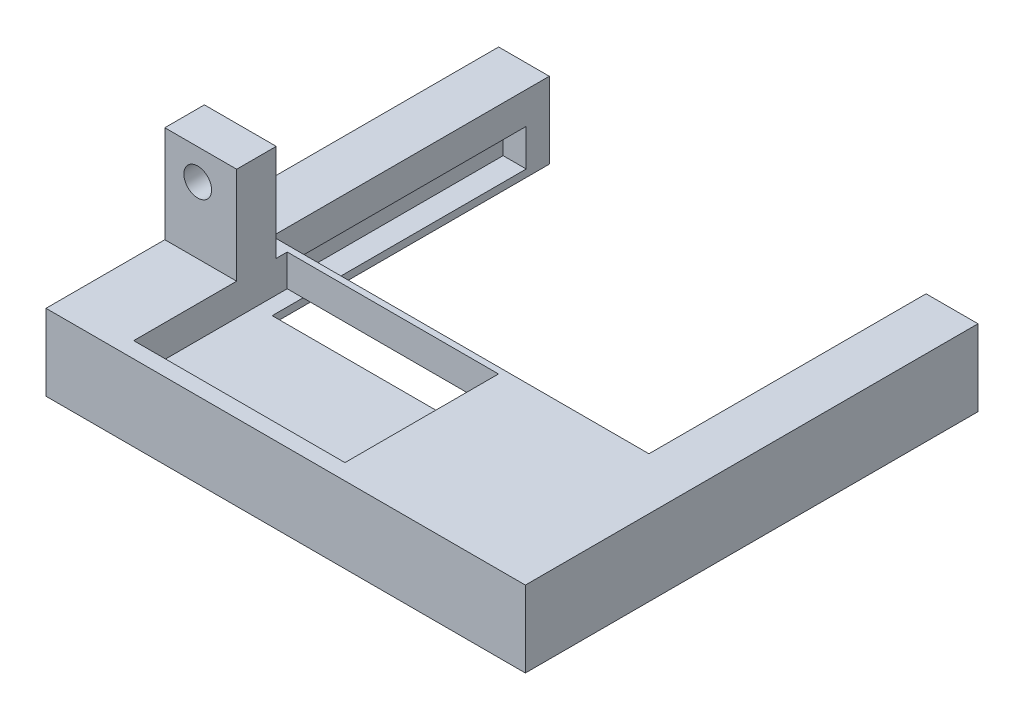
ISO-10303-21;
HEADER;
FILE_DESCRIPTION(('STEP AP214'),'2;1');
FILE_NAME('part.step','',(''),(''),'','','');
FILE_SCHEMA(('AUTOMOTIVE_DESIGN { 1 0 10303 214 1 1 1 1 }'));
ENDSEC;
DATA;
#1=APPLICATION_CONTEXT('core data for automotive mechanical design processes');
#2=APPLICATION_PROTOCOL_DEFINITION('international standard','automotive_design',2000,#1);
#3=PRODUCT_CONTEXT('',#1,'mechanical');
#4=PRODUCT('Part','Part','',(#3));
#5=PRODUCT_RELATED_PRODUCT_CATEGORY('part','',(#4));
#6=PRODUCT_DEFINITION_FORMATION('','',#4);
#7=PRODUCT_DEFINITION_CONTEXT('part definition',#1,'design');
#8=PRODUCT_DEFINITION('design','',#6,#7);
#9=PRODUCT_DEFINITION_SHAPE('','',#8);
#10=(LENGTH_UNIT() NAMED_UNIT(*) SI_UNIT(.MILLI.,.METRE.));
#11=(NAMED_UNIT(*) PLANE_ANGLE_UNIT() SI_UNIT($,.RADIAN.));
#12=(NAMED_UNIT(*) SI_UNIT($,.STERADIAN.) SOLID_ANGLE_UNIT());
#13=UNCERTAINTY_MEASURE_WITH_UNIT(LENGTH_MEASURE(1.E-05),#10,'distance_accuracy_value','');
#14=(GEOMETRIC_REPRESENTATION_CONTEXT(3) GLOBAL_UNCERTAINTY_ASSIGNED_CONTEXT((#13)) GLOBAL_UNIT_ASSIGNED_CONTEXT((#10,
#11,#12)) REPRESENTATION_CONTEXT('',''));
#15=CARTESIAN_POINT('',(0.,0.,0.));
#16=DIRECTION('',(0.,0.,1.));
#17=DIRECTION('',(1.,0.,0.));
#18=AXIS2_PLACEMENT_3D('',#15,#16,#17);
#19=CARTESIAN_POINT('',(-53.8026861703145,16.2377760510406,49.));
#20=DIRECTION('',(0.,-1.,0.));
#21=DIRECTION('',(0.,0.,-1.));
#22=AXIS2_PLACEMENT_3D('',#19,#20,#21);
#23=PLANE('',#22);
#24=DIRECTION('',(-1.,0.,0.));
#25=VECTOR('',#24,1.);
#26=CARTESIAN_POINT('',(-53.8026861703145,16.2377760510406,31.8534955891993));
#27=LINE('',#26,#25);
#28=CARTESIAN_POINT('',(-46.0237778029864,16.2377760510406,31.8534955891993));
#29=VERTEX_POINT('',#28);
#30=CARTESIAN_POINT('',(-53.8026861703145,16.2377760510406,31.8534955891993));
#31=VERTEX_POINT('',#30);
#32=EDGE_CURVE('E49',#29,#31,#27,.T.);
#33=ORIENTED_EDGE('',*,*,#32,.F.);
#34=DIRECTION('',(0.,0.,1.));
#35=VECTOR('',#34,1.);
#36=CARTESIAN_POINT('',(-46.0237778029864,16.2377760510406,30.6644437435466));
#37=LINE('',#36,#35);
#38=CARTESIAN_POINT('',(-46.0237778029864,16.2377760510406,30.6644437435466));
#39=VERTEX_POINT('',#38);
#40=EDGE_CURVE('E300',#39,#29,#37,.T.);
#41=ORIENTED_EDGE('',*,*,#40,.F.);
#42=DIRECTION('',(1.,0.,0.));
#43=VECTOR('',#42,1.);
#44=CARTESIAN_POINT('',(-46.0237778029864,16.2377760510406,30.6644437435466));
#45=LINE('',#44,#43);
#46=CARTESIAN_POINT('',(-23.1539622270134,16.2377760510406,30.6644437435466));
#47=VERTEX_POINT('',#46);
#48=EDGE_CURVE('E289',#39,#47,#45,.T.);
#49=ORIENTED_EDGE('',*,*,#48,.T.);
#50=DIRECTION('',(0.,0.,1.));
#51=VECTOR('',#50,1.);
#52=CARTESIAN_POINT('',(-23.1539622270134,16.2377760510406,30.6644437435466));
#53=LINE('',#52,#51);
#54=CARTESIAN_POINT('',(-23.1539622270134,16.2377760510406,47.2844241556345));
#55=VERTEX_POINT('',#54);
#56=EDGE_CURVE('E293',#47,#55,#53,.T.);
#57=ORIENTED_EDGE('',*,*,#56,.T.);
#58=DIRECTION('',(1.,0.,0.));
#59=VECTOR('',#58,1.);
#60=CARTESIAN_POINT('',(-46.0237778029864,16.2377760510406,47.2844241556345));
#61=LINE('',#60,#59);
#62=CARTESIAN_POINT('',(-46.0237778029864,16.2377760510406,47.2844241556345));
#63=VERTEX_POINT('',#62);
#64=EDGE_CURVE('E296',#63,#55,#61,.T.);
#65=ORIENTED_EDGE('',*,*,#64,.F.);
#66=CARTESIAN_POINT('',(-46.0237778029864,16.2377760510406,36.1384589133983));
#67=VERTEX_POINT('',#66);
#68=EDGE_CURVE('E299',#67,#63,#37,.T.);
#69=ORIENTED_EDGE('',*,*,#68,.F.);
#70=DIRECTION('',(1.,0.,0.));
#71=VECTOR('',#70,1.);
#72=CARTESIAN_POINT('',(-53.8026861703145,16.2377760510406,36.1384589133983));
#73=LINE('',#72,#71);
#74=CARTESIAN_POINT('',(-53.8026861703145,16.2377760510406,36.1384589133983));
#75=VERTEX_POINT('',#74);
#76=EDGE_CURVE('E419',#75,#67,#73,.T.);
#77=ORIENTED_EDGE('',*,*,#76,.F.);
#78=DIRECTION('',(0.,0.,-1.));
#79=VECTOR('',#78,1.);
#80=CARTESIAN_POINT('',(-53.8026861703145,16.2377760510406,49.));
#81=LINE('',#80,#79);
#82=CARTESIAN_POINT('',(-53.8026861703145,16.2377760510406,49.));
#83=VERTEX_POINT('',#82);
#84=EDGE_CURVE('E219',#83,#75,#81,.T.);
#85=ORIENTED_EDGE('',*,*,#84,.F.);
#86=DIRECTION('',(-1.,0.,0.));
#87=VECTOR('',#86,1.);
#88=CARTESIAN_POINT('',(-53.8026861703145,16.2377760510406,49.));
#89=LINE('',#88,#87);
#90=CARTESIAN_POINT('',(-1.90676536553269,16.2377760510406,49.));
#91=VERTEX_POINT('',#90);
#92=EDGE_CURVE('E344',#91,#83,#89,.T.);
#93=ORIENTED_EDGE('',*,*,#92,.F.);
#94=DIRECTION('',(0.,0.,-1.));
#95=VECTOR('',#94,1.);
#96=CARTESIAN_POINT('',(-1.90676536553269,16.2377760510406,49.));
#97=LINE('',#96,#95);
#98=CARTESIAN_POINT('',(-1.90676536553269,16.2377760510406,0.));
#99=VERTEX_POINT('',#98);
#100=EDGE_CURVE('E42',#91,#99,#97,.T.);
#101=ORIENTED_EDGE('',*,*,#100,.T.);
#102=DIRECTION('',(-1.,0.,0.));
#103=VECTOR('',#102,1.);
#104=CARTESIAN_POINT('',(-53.8026861703145,16.2377760510406,0.));
#105=LINE('',#104,#103);
#106=CARTESIAN_POINT('',(-7.526984080159,16.2377760510406,0.));
#107=VERTEX_POINT('',#106);
#108=EDGE_CURVE('E355',#99,#107,#105,.T.);
#109=ORIENTED_EDGE('',*,*,#108,.T.);
#110=DIRECTION('',(0.,0.,-1.));
#111=VECTOR('',#110,1.);
#112=CARTESIAN_POINT('',(-7.526984080159,16.2377760510406,30.));
#113=LINE('',#112,#111);
#114=CARTESIAN_POINT('',(-7.526984080159,16.2377760510406,30.));
#115=VERTEX_POINT('',#114);
#116=EDGE_CURVE('E327',#115,#107,#113,.T.);
#117=ORIENTED_EDGE('',*,*,#116,.F.);
#118=DIRECTION('',(-1.,0.,0.));
#119=VECTOR('',#118,1.);
#120=CARTESIAN_POINT('',(-7.526984080159,16.2377760510406,30.));
#121=LINE('',#120,#119);
#122=CARTESIAN_POINT('',(-48.3159584688224,16.2377760510406,30.));
#123=VERTEX_POINT('',#122);
#124=EDGE_CURVE('E312',#115,#123,#121,.T.);
#125=ORIENTED_EDGE('',*,*,#124,.T.);
#126=DIRECTION('',(0.,0.,-1.));
#127=VECTOR('',#126,1.);
#128=CARTESIAN_POINT('',(-48.3159584688224,16.2377760510406,30.));
#129=LINE('',#128,#127);
#130=CARTESIAN_POINT('',(-48.3159584688224,16.2377760510406,0.));
#131=VERTEX_POINT('',#130);
#132=EDGE_CURVE('E337',#123,#131,#129,.T.);
#133=ORIENTED_EDGE('',*,*,#132,.T.);
#134=CARTESIAN_POINT('',(-53.8026861703145,16.2377760510406,0.));
#135=VERTEX_POINT('',#134);
#136=EDGE_CURVE('E354',#131,#135,#105,.T.);
#137=ORIENTED_EDGE('',*,*,#136,.T.);
#138=EDGE_CURVE('E54',#31,#135,#81,.T.);
#139=ORIENTED_EDGE('',*,*,#138,.F.);
#140=EDGE_LOOP('',(#33,#41,#49,#57,#65,#69,#77,#85,#93,#101,#109,#117,#125,#133,#137,#139));
#141=FACE_BOUND('',#140,.T.);
#142=ADVANCED_FACE('F33',(#141),#23,.F.);
#143=CARTESIAN_POINT('',(0.,0.,30.));
#144=DIRECTION('',(0.,0.,1.));
#145=DIRECTION('',(1.,0.,0.));
#146=AXIS2_PLACEMENT_3D('',#143,#144,#145);
#147=PLANE('',#146);
#148=DIRECTION('',(0.,-1.,0.));
#149=VECTOR('',#148,1.);
#150=CARTESIAN_POINT('',(-7.526984080159,16.2377760510406,30.));
#151=LINE('',#150,#149);
#152=CARTESIAN_POINT('',(-7.526984080159,12.7911909617181,30.));
#153=VERTEX_POINT('',#152);
#154=EDGE_CURVE('E324',#115,#153,#151,.T.);
#155=ORIENTED_EDGE('',*,*,#154,.T.);
#156=DIRECTION('',(1.,0.,0.));
#157=VECTOR('',#156,1.);
#158=CARTESIAN_POINT('',(-5.026984080159,12.7911909617181,30.));
#159=LINE('',#158,#157);
#160=CARTESIAN_POINT('',(-48.3159584688224,12.7911909617181,30.));
#161=VERTEX_POINT('',#160);
#162=EDGE_CURVE('E222',#161,#153,#159,.T.);
#163=ORIENTED_EDGE('',*,*,#162,.F.);
#164=DIRECTION('',(0.,-1.,0.));
#165=VECTOR('',#164,1.);
#166=CARTESIAN_POINT('',(-48.3159584688224,16.2377760510406,30.));
#167=LINE('',#166,#165);
#168=EDGE_CURVE('E317',#123,#161,#167,.T.);
#169=ORIENTED_EDGE('',*,*,#168,.F.);
#170=ORIENTED_EDGE('',*,*,#124,.F.);
#171=EDGE_LOOP('',(#155,#163,#169,#170));
#172=FACE_BOUND('',#171,.T.);
#173=ADVANCED_FACE('F407',(#172),#147,.F.);
#174=CARTESIAN_POINT('',(-53.8026861703145,7.99119096171808,49.));
#175=DIRECTION('',(0.,1.,0.));
#176=DIRECTION('',(0.,0.,1.));
#177=AXIS2_PLACEMENT_3D('',#174,#175,#176);
#178=PLANE('',#177);
#179=DIRECTION('',(0.,0.,-1.));
#180=VECTOR('',#179,1.);
#181=CARTESIAN_POINT('',(-48.3159584688224,7.99119096171808,30.));
#182=LINE('',#181,#180);
#183=CARTESIAN_POINT('',(-48.3159584688224,7.99119096171808,30.));
#184=VERTEX_POINT('',#183);
#185=CARTESIAN_POINT('',(-48.3159584688224,7.99119096171808,0.));
#186=VERTEX_POINT('',#185);
#187=EDGE_CURVE('E335',#184,#186,#182,.T.);
#188=ORIENTED_EDGE('',*,*,#187,.F.);
#189=DIRECTION('',(-1.,0.,0.));
#190=VECTOR('',#189,1.);
#191=CARTESIAN_POINT('',(-7.526984080159,7.99119096171808,30.));
#192=LINE('',#191,#190);
#193=CARTESIAN_POINT('',(-7.526984080159,7.99119096171808,30.));
#194=VERTEX_POINT('',#193);
#195=EDGE_CURVE('E320',#194,#184,#192,.T.);
#196=ORIENTED_EDGE('',*,*,#195,.F.);
#197=DIRECTION('',(0.,0.,-1.));
#198=VECTOR('',#197,1.);
#199=CARTESIAN_POINT('',(-7.526984080159,7.99119096171808,30.));
#200=LINE('',#199,#198);
#201=CARTESIAN_POINT('',(-7.526984080159,7.99119096171808,0.));
#202=VERTEX_POINT('',#201);
#203=EDGE_CURVE('E332',#194,#202,#200,.T.);
#204=ORIENTED_EDGE('',*,*,#203,.T.);
#205=DIRECTION('',(1.,0.,0.));
#206=VECTOR('',#205,1.);
#207=CARTESIAN_POINT('',(-53.8026861703145,7.99119096171808,0.));
#208=LINE('',#207,#206);
#209=CARTESIAN_POINT('',(-1.90676536553269,7.99119096171808,0.));
#210=VERTEX_POINT('',#209);
#211=EDGE_CURVE('E360',#202,#210,#208,.T.);
#212=ORIENTED_EDGE('',*,*,#211,.T.);
#213=DIRECTION('',(0.,0.,-1.));
#214=VECTOR('',#213,1.);
#215=CARTESIAN_POINT('',(-1.90676536553269,7.99119096171808,49.));
#216=LINE('',#215,#214);
#217=CARTESIAN_POINT('',(-1.90676536553269,7.99119096171808,49.));
#218=VERTEX_POINT('',#217);
#219=EDGE_CURVE('E351',#218,#210,#216,.T.);
#220=ORIENTED_EDGE('',*,*,#219,.F.);
#221=DIRECTION('',(1.,0.,0.));
#222=VECTOR('',#221,1.);
#223=CARTESIAN_POINT('',(-53.8026861703145,7.99119096171808,49.));
#224=LINE('',#223,#222);
#225=CARTESIAN_POINT('',(-53.8026861703145,7.99119096171808,49.));
#226=VERTEX_POINT('',#225);
#227=EDGE_CURVE('E349',#226,#218,#224,.T.);
#228=ORIENTED_EDGE('',*,*,#227,.F.);
#229=DIRECTION('',(0.,0.,-1.));
#230=VECTOR('',#229,1.);
#231=CARTESIAN_POINT('',(-53.8026861703145,7.99119096171808,49.));
#232=LINE('',#231,#230);
#233=CARTESIAN_POINT('',(-53.8026861703145,7.99119096171808,0.));
#234=VERTEX_POINT('',#233);
#235=EDGE_CURVE('E365',#226,#234,#232,.T.);
#236=ORIENTED_EDGE('',*,*,#235,.T.);
#237=EDGE_CURVE('E345',#234,#186,#208,.T.);
#238=ORIENTED_EDGE('',*,*,#237,.T.);
#239=EDGE_LOOP('',(#188,#196,#204,#212,#220,#228,#236,#238));
#240=FACE_BOUND('',#239,.T.);
#241=ADVANCED_FACE('F389',(#240),#178,.F.);
#242=CARTESIAN_POINT('',(0.,0.,0.));
#243=DIRECTION('',(0.,0.,1.));
#244=DIRECTION('',(1.,0.,0.));
#245=AXIS2_PLACEMENT_3D('',#242,#243,#244);
#246=PLANE('',#245);
#247=DIRECTION('',(0.,-1.,0.));
#248=VECTOR('',#247,1.);
#249=CARTESIAN_POINT('',(-48.3159584688224,16.2377760510406,0.));
#250=LINE('',#249,#248);
#251=EDGE_CURVE('E311',#131,#186,#250,.T.);
#252=ORIENTED_EDGE('',*,*,#251,.T.);
#253=ORIENTED_EDGE('',*,*,#237,.F.);
#254=DIRECTION('',(0.,-1.,0.));
#255=VECTOR('',#254,1.);
#256=CARTESIAN_POINT('',(-53.8026861703145,16.2377760510406,0.));
#257=LINE('',#256,#255);
#258=EDGE_CURVE('E358',#135,#234,#257,.T.);
#259=ORIENTED_EDGE('',*,*,#258,.F.);
#260=ORIENTED_EDGE('',*,*,#136,.F.);
#261=EDGE_LOOP('',(#252,#253,#259,#260));
#262=FACE_BOUND('',#261,.T.);
#263=ADVANCED_FACE('F413',(#262),#246,.F.);
#264=CARTESIAN_POINT('',(-1.90676536553269,16.2377760510406,49.));
#265=DIRECTION('',(-1.,0.,0.));
#266=DIRECTION('',(0.,0.,1.));
#267=AXIS2_PLACEMENT_3D('',#264,#265,#266);
#268=PLANE('',#267);
#269=DIRECTION('',(0.,1.,0.));
#270=VECTOR('',#269,1.);
#271=CARTESIAN_POINT('',(-1.90676536553269,16.2377760510406,0.));
#272=LINE('',#271,#270);
#273=EDGE_CURVE('E340',#210,#99,#272,.T.);
#274=ORIENTED_EDGE('',*,*,#273,.T.);
#275=ORIENTED_EDGE('',*,*,#100,.F.);
#276=DIRECTION('',(0.,1.,0.));
#277=VECTOR('',#276,1.);
#278=CARTESIAN_POINT('',(-1.90676536553269,16.2377760510406,49.));
#279=LINE('',#278,#277);
#280=EDGE_CURVE('E341',#218,#91,#279,.T.);
#281=ORIENTED_EDGE('',*,*,#280,.F.);
#282=ORIENTED_EDGE('',*,*,#219,.T.);
#283=EDGE_LOOP('',(#274,#275,#281,#282));
#284=FACE_BOUND('',#283,.T.);
#285=ADVANCED_FACE('F35',(#284),#268,.F.);
#286=CARTESIAN_POINT('',(-53.8026861703145,16.2377760510406,49.));
#287=DIRECTION('',(1.,0.,0.));
#288=DIRECTION('',(0.,0.,-1.));
#289=AXIS2_PLACEMENT_3D('',#286,#287,#288);
#290=PLANE('',#289);
#291=ORIENTED_EDGE('',*,*,#258,.T.);
#292=ORIENTED_EDGE('',*,*,#235,.F.);
#293=DIRECTION('',(0.,-1.,0.));
#294=VECTOR('',#293,1.);
#295=CARTESIAN_POINT('',(-53.8026861703145,16.2377760510406,49.));
#296=LINE('',#295,#294);
#297=EDGE_CURVE('E347',#83,#226,#296,.T.);
#298=ORIENTED_EDGE('',*,*,#297,.F.);
#299=ORIENTED_EDGE('',*,*,#84,.T.);
#300=DIRECTION('',(0.,-1.,0.));
#301=VECTOR('',#300,1.);
#302=CARTESIAN_POINT('',(-53.8026861703145,26.7377760510406,36.1384589133983));
#303=LINE('',#302,#301);
#304=CARTESIAN_POINT('',(-53.8026861703145,26.7377760510406,36.1384589133983));
#305=VERTEX_POINT('',#304);
#306=EDGE_CURVE('E199',#305,#75,#303,.T.);
#307=ORIENTED_EDGE('',*,*,#306,.F.);
#308=DIRECTION('',(0.,0.,1.));
#309=VECTOR('',#308,1.);
#310=CARTESIAN_POINT('',(-53.8026861703145,26.7377760510406,31.8534955891993));
#311=LINE('',#310,#309);
#312=CARTESIAN_POINT('',(-53.8026861703145,26.7377760510406,31.8534955891993));
#313=VERTEX_POINT('',#312);
#314=EDGE_CURVE('E205',#313,#305,#311,.T.);
#315=ORIENTED_EDGE('',*,*,#314,.F.);
#316=DIRECTION('',(0.,-1.,0.));
#317=VECTOR('',#316,1.);
#318=CARTESIAN_POINT('',(-53.8026861703145,26.7377760510406,31.8534955891993));
#319=LINE('',#318,#317);
#320=EDGE_CURVE('E428',#313,#31,#319,.T.);
#321=ORIENTED_EDGE('',*,*,#320,.T.);
#322=ORIENTED_EDGE('',*,*,#138,.T.);
#323=EDGE_LOOP('',(#291,#292,#298,#299,#307,#315,#321,#322));
#324=FACE_BOUND('',#323,.T.);
#325=ADVANCED_FACE('F216',(#324),#290,.F.);
#326=CARTESIAN_POINT('',(0.,0.,49.));
#327=DIRECTION('',(0.,0.,1.));
#328=DIRECTION('',(1.,0.,0.));
#329=AXIS2_PLACEMENT_3D('',#326,#327,#328);
#330=PLANE('',#329);
#331=ORIENTED_EDGE('',*,*,#280,.T.);
#332=ORIENTED_EDGE('',*,*,#92,.T.);
#333=ORIENTED_EDGE('',*,*,#297,.T.);
#334=ORIENTED_EDGE('',*,*,#227,.T.);
#335=EDGE_LOOP('',(#331,#332,#333,#334));
#336=FACE_BOUND('',#335,.T.);
#337=ADVANCED_FACE('F418',(#336),#330,.T.);
#338=ORIENTED_EDGE('',*,*,#211,.F.);
#339=DIRECTION('',(0.,-1.,0.));
#340=VECTOR('',#339,1.);
#341=CARTESIAN_POINT('',(-7.526984080159,16.2377760510406,0.));
#342=LINE('',#341,#340);
#343=EDGE_CURVE('E316',#107,#202,#342,.T.);
#344=ORIENTED_EDGE('',*,*,#343,.F.);
#345=ORIENTED_EDGE('',*,*,#108,.F.);
#346=ORIENTED_EDGE('',*,*,#273,.F.);
#347=EDGE_LOOP('',(#338,#344,#345,#346));
#348=FACE_BOUND('',#347,.T.);
#349=ADVANCED_FACE('F378',(#348),#246,.F.);
#350=CARTESIAN_POINT('',(-48.3159584688224,16.2377760510406,30.));
#351=DIRECTION('',(1.,0.,0.));
#352=DIRECTION('',(0.,0.,-1.));
#353=AXIS2_PLACEMENT_3D('',#350,#351,#352);
#354=PLANE('',#353);
#355=DIRECTION('',(0.,0.,-1.));
#356=VECTOR('',#355,1.);
#357=CARTESIAN_POINT('',(-48.3159584688224,8.79119096171808,2.5));
#358=LINE('',#357,#356);
#359=CARTESIAN_POINT('',(-48.3159584688224,8.79119096171807,30.));
#360=VERTEX_POINT('',#359);
#361=CARTESIAN_POINT('',(-48.3159584688224,8.79119096171808,2.5));
#362=VERTEX_POINT('',#361);
#363=EDGE_CURVE('E253',#360,#362,#358,.T.);
#364=ORIENTED_EDGE('',*,*,#363,.F.);
#365=EDGE_CURVE('E315',#360,#184,#167,.T.);
#366=ORIENTED_EDGE('',*,*,#365,.T.);
#367=ORIENTED_EDGE('',*,*,#187,.T.);
#368=ORIENTED_EDGE('',*,*,#251,.F.);
#369=ORIENTED_EDGE('',*,*,#132,.F.);
#370=ORIENTED_EDGE('',*,*,#168,.T.);
#371=DIRECTION('',(0.,0.,1.));
#372=VECTOR('',#371,1.);
#373=CARTESIAN_POINT('',(-48.3159584688224,12.7911909617181,2.5));
#374=LINE('',#373,#372);
#375=CARTESIAN_POINT('',(-48.3159584688224,12.7911909617181,2.5));
#376=VERTEX_POINT('',#375);
#377=EDGE_CURVE('E261',#376,#161,#374,.T.);
#378=ORIENTED_EDGE('',*,*,#377,.F.);
#379=DIRECTION('',(0.,1.,0.));
#380=VECTOR('',#379,1.);
#381=CARTESIAN_POINT('',(-48.3159584688224,12.7911909617181,2.5));
#382=LINE('',#381,#380);
#383=EDGE_CURVE('E248',#362,#376,#382,.T.);
#384=ORIENTED_EDGE('',*,*,#383,.F.);
#385=EDGE_LOOP('',(#364,#366,#367,#368,#369,#370,#378,#384));
#386=FACE_BOUND('',#385,.T.);
#387=ADVANCED_FACE('F471',(#386),#354,.T.);
#388=CARTESIAN_POINT('',(-7.526984080159,16.2377760510406,30.));
#389=DIRECTION('',(1.,0.,0.));
#390=DIRECTION('',(0.,1.,0.));
#391=AXIS2_PLACEMENT_3D('',#388,#389,#390);
#392=PLANE('',#391);
#393=DIRECTION('',(0.,-1.,0.));
#394=VECTOR('',#393,1.);
#395=CARTESIAN_POINT('',(-7.526984080159,12.7911909617181,2.5));
#396=LINE('',#395,#394);
#397=CARTESIAN_POINT('',(-7.526984080159,12.7911909617181,2.5));
#398=VERTEX_POINT('',#397);
#399=CARTESIAN_POINT('',(-7.526984080159,8.79119096171808,2.5));
#400=VERTEX_POINT('',#399);
#401=EDGE_CURVE('E268',#398,#400,#396,.T.);
#402=ORIENTED_EDGE('',*,*,#401,.F.);
#403=DIRECTION('',(0.,0.,-1.));
#404=VECTOR('',#403,1.);
#405=CARTESIAN_POINT('',(-7.526984080159,12.7911909617181,2.5));
#406=LINE('',#405,#404);
#407=EDGE_CURVE('E274',#153,#398,#406,.T.);
#408=ORIENTED_EDGE('',*,*,#407,.F.);
#409=ORIENTED_EDGE('',*,*,#154,.F.);
#410=ORIENTED_EDGE('',*,*,#116,.T.);
#411=ORIENTED_EDGE('',*,*,#343,.T.);
#412=ORIENTED_EDGE('',*,*,#203,.F.);
#413=CARTESIAN_POINT('',(-7.526984080159,8.79119096171807,30.));
#414=VERTEX_POINT('',#413);
#415=EDGE_CURVE('E323',#414,#194,#151,.T.);
#416=ORIENTED_EDGE('',*,*,#415,.F.);
#417=DIRECTION('',(0.,0.,1.));
#418=VECTOR('',#417,1.);
#419=CARTESIAN_POINT('',(-7.526984080159,8.79119096171808,2.5));
#420=LINE('',#419,#418);
#421=EDGE_CURVE('E282',#400,#414,#420,.T.);
#422=ORIENTED_EDGE('',*,*,#421,.F.);
#423=EDGE_LOOP('',(#402,#408,#409,#410,#411,#412,#416,#422));
#424=FACE_BOUND('',#423,.T.);
#425=ADVANCED_FACE('F383',(#424),#392,.F.);
#426=ORIENTED_EDGE('',*,*,#365,.F.);
#427=DIRECTION('',(-1.,0.,0.));
#428=VECTOR('',#427,1.);
#429=CARTESIAN_POINT('',(-5.026984080159,8.79119096171807,30.));
#430=LINE('',#429,#428);
#431=EDGE_CURVE('E220',#414,#360,#430,.T.);
#432=ORIENTED_EDGE('',*,*,#431,.F.);
#433=ORIENTED_EDGE('',*,*,#415,.T.);
#434=ORIENTED_EDGE('',*,*,#195,.T.);
#435=EDGE_LOOP('',(#426,#432,#433,#434));
#436=FACE_BOUND('',#435,.T.);
#437=ADVANCED_FACE('F392',(#436),#147,.F.);
#438=CARTESIAN_POINT('',(-46.0237778029864,10.2377760510406,30.6644437435466));
#439=DIRECTION('',(0.,0.,1.));
#440=DIRECTION('',(1.,0.,0.));
#441=AXIS2_PLACEMENT_3D('',#438,#439,#440);
#442=PLANE('',#441);
#443=DIRECTION('',(-1.,0.,0.));
#444=VECTOR('',#443,1.);
#445=CARTESIAN_POINT('',(-46.0237778029864,12.7911909617181,30.6644437435466));
#446=LINE('',#445,#444);
#447=CARTESIAN_POINT('',(-23.1539622270134,12.7911909617181,30.6644437435466));
#448=VERTEX_POINT('',#447);
#449=CARTESIAN_POINT('',(-46.0237778029864,12.7911909617181,30.6644437435466));
#450=VERTEX_POINT('',#449);
#451=EDGE_CURVE('E246',#448,#450,#446,.T.);
#452=ORIENTED_EDGE('',*,*,#451,.F.);
#453=DIRECTION('',(0.,1.,0.));
#454=VECTOR('',#453,1.);
#455=CARTESIAN_POINT('',(-23.1539622270134,10.2377760510406,30.6644437435466));
#456=LINE('',#455,#454);
#457=EDGE_CURVE('E309',#448,#47,#456,.T.);
#458=ORIENTED_EDGE('',*,*,#457,.T.);
#459=ORIENTED_EDGE('',*,*,#48,.F.);
#460=DIRECTION('',(0.,1.,0.));
#461=VECTOR('',#460,1.);
#462=CARTESIAN_POINT('',(-46.0237778029864,10.2377760510406,30.6644437435466));
#463=LINE('',#462,#461);
#464=EDGE_CURVE('E302',#450,#39,#463,.T.);
#465=ORIENTED_EDGE('',*,*,#464,.F.);
#466=EDGE_LOOP('',(#452,#458,#459,#465));
#467=FACE_BOUND('',#466,.T.);
#468=ADVANCED_FACE('F441',(#467),#442,.T.);
#469=CARTESIAN_POINT('',(-23.1539622270134,10.2377760510406,30.6644437435466));
#470=DIRECTION('',(-1.,0.,0.));
#471=DIRECTION('',(0.,0.,1.));
#472=AXIS2_PLACEMENT_3D('',#469,#470,#471);
#473=PLANE('',#472);
#474=DIRECTION('',(0.,0.,-1.));
#475=VECTOR('',#474,1.);
#476=CARTESIAN_POINT('',(-23.1539622270134,12.7911909617181,30.6644437435466));
#477=LINE('',#476,#475);
#478=CARTESIAN_POINT('',(-23.1539622270134,12.7911909617181,47.2844241556345));
#479=VERTEX_POINT('',#478);
#480=EDGE_CURVE('E244',#479,#448,#477,.T.);
#481=ORIENTED_EDGE('',*,*,#480,.F.);
#482=DIRECTION('',(0.,1.,0.));
#483=VECTOR('',#482,1.);
#484=CARTESIAN_POINT('',(-23.1539622270134,10.2377760510406,47.2844241556345));
#485=LINE('',#484,#483);
#486=EDGE_CURVE('E307',#479,#55,#485,.T.);
#487=ORIENTED_EDGE('',*,*,#486,.T.);
#488=ORIENTED_EDGE('',*,*,#56,.F.);
#489=ORIENTED_EDGE('',*,*,#457,.F.);
#490=EDGE_LOOP('',(#481,#487,#488,#489));
#491=FACE_BOUND('',#490,.T.);
#492=ADVANCED_FACE('F445',(#491),#473,.T.);
#493=CARTESIAN_POINT('',(-46.0237778029864,10.2377760510406,47.2844241556345));
#494=DIRECTION('',(0.,0.,1.));
#495=DIRECTION('',(1.,0.,0.));
#496=AXIS2_PLACEMENT_3D('',#493,#494,#495);
#497=PLANE('',#496);
#498=ORIENTED_EDGE('',*,*,#486,.F.);
#499=DIRECTION('',(-1.,0.,0.));
#500=VECTOR('',#499,1.);
#501=CARTESIAN_POINT('',(-46.0237778029864,12.7911909617181,47.2844241556345));
#502=LINE('',#501,#500);
#503=CARTESIAN_POINT('',(-46.0237778029864,12.7911909617181,47.2844241556345));
#504=VERTEX_POINT('',#503);
#505=EDGE_CURVE('E239',#479,#504,#502,.T.);
#506=ORIENTED_EDGE('',*,*,#505,.T.);
#507=DIRECTION('',(0.,1.,0.));
#508=VECTOR('',#507,1.);
#509=CARTESIAN_POINT('',(-46.0237778029864,10.2377760510406,47.2844241556345));
#510=LINE('',#509,#508);
#511=EDGE_CURVE('E304',#504,#63,#510,.T.);
#512=ORIENTED_EDGE('',*,*,#511,.T.);
#513=ORIENTED_EDGE('',*,*,#64,.T.);
#514=EDGE_LOOP('',(#498,#506,#512,#513));
#515=FACE_BOUND('',#514,.T.);
#516=ADVANCED_FACE('F448',(#515),#497,.F.);
#517=CARTESIAN_POINT('',(-46.0237778029864,10.2377760510406,30.6644437435466));
#518=DIRECTION('',(-1.,0.,0.));
#519=DIRECTION('',(0.,0.,1.));
#520=AXIS2_PLACEMENT_3D('',#517,#518,#519);
#521=PLANE('',#520);
#522=ORIENTED_EDGE('',*,*,#511,.F.);
#523=DIRECTION('',(0.,0.,-1.));
#524=VECTOR('',#523,1.);
#525=CARTESIAN_POINT('',(-46.0237778029864,12.7911909617181,30.6644437435466));
#526=LINE('',#525,#524);
#527=EDGE_CURVE('E11',#504,#450,#526,.T.);
#528=ORIENTED_EDGE('',*,*,#527,.T.);
#529=ORIENTED_EDGE('',*,*,#464,.T.);
#530=ORIENTED_EDGE('',*,*,#40,.T.);
#531=DIRECTION('',(0.,-1.,0.));
#532=VECTOR('',#531,1.);
#533=CARTESIAN_POINT('',(-46.0237778029864,26.7377760510406,31.8534955891993));
#534=LINE('',#533,#532);
#535=CARTESIAN_POINT('',(-46.0237778029864,26.7377760510406,31.8534955891993));
#536=VERTEX_POINT('',#535);
#537=EDGE_CURVE('E224',#536,#29,#534,.T.);
#538=ORIENTED_EDGE('',*,*,#537,.F.);
#539=DIRECTION('',(0.,0.,-1.));
#540=VECTOR('',#539,1.);
#541=CARTESIAN_POINT('',(-46.0237778029864,26.7377760510406,31.8534955891993));
#542=LINE('',#541,#540);
#543=CARTESIAN_POINT('',(-46.0237778029864,26.7377760510406,36.1384589133983));
#544=VERTEX_POINT('',#543);
#545=EDGE_CURVE('E204',#544,#536,#542,.T.);
#546=ORIENTED_EDGE('',*,*,#545,.F.);
#547=DIRECTION('',(0.,-1.,0.));
#548=VECTOR('',#547,1.);
#549=CARTESIAN_POINT('',(-46.0237778029864,26.7377760510406,36.1384589133983));
#550=LINE('',#549,#548);
#551=EDGE_CURVE('E201',#544,#67,#550,.T.);
#552=ORIENTED_EDGE('',*,*,#551,.T.);
#553=ORIENTED_EDGE('',*,*,#68,.T.);
#554=EDGE_LOOP('',(#522,#528,#529,#530,#538,#546,#552,#553));
#555=FACE_BOUND('',#554,.T.);
#556=ADVANCED_FACE('F435',(#555),#521,.F.);
#557=CARTESIAN_POINT('',(-5.026984080159,12.7911909617181,2.5));
#558=DIRECTION('',(0.,0.,-1.));
#559=DIRECTION('',(0.,1.,0.));
#560=AXIS2_PLACEMENT_3D('',#557,#558,#559);
#561=PLANE('',#560);
#562=ORIENTED_EDGE('',*,*,#401,.T.);
#563=DIRECTION('',(-1.,0.,0.));
#564=VECTOR('',#563,1.);
#565=CARTESIAN_POINT('',(-5.026984080159,8.79119096171808,2.5));
#566=LINE('',#565,#564);
#567=CARTESIAN_POINT('',(-5.026984080159,8.79119096171808,2.5));
#568=VERTEX_POINT('',#567);
#569=EDGE_CURVE('E279',#568,#400,#566,.T.);
#570=ORIENTED_EDGE('',*,*,#569,.F.);
#571=DIRECTION('',(0.,-1.,0.));
#572=VECTOR('',#571,1.);
#573=CARTESIAN_POINT('',(-5.026984080159,12.7911909617181,2.5));
#574=LINE('',#573,#572);
#575=CARTESIAN_POINT('',(-5.026984080159,12.7911909617181,2.5));
#576=VERTEX_POINT('',#575);
#577=EDGE_CURVE('E270',#576,#568,#574,.T.);
#578=ORIENTED_EDGE('',*,*,#577,.F.);
#579=DIRECTION('',(-1.,0.,0.));
#580=VECTOR('',#579,1.);
#581=CARTESIAN_POINT('',(-5.026984080159,12.7911909617181,2.5));
#582=LINE('',#581,#580);
#583=EDGE_CURVE('E287',#576,#398,#582,.T.);
#584=ORIENTED_EDGE('',*,*,#583,.T.);
#585=EDGE_LOOP('',(#562,#570,#578,#584));
#586=FACE_BOUND('',#585,.T.);
#587=ADVANCED_FACE('F402',(#586),#561,.F.);
#588=CARTESIAN_POINT('',(-5.026984080159,12.7911909617181,2.5));
#589=DIRECTION('',(0.,1.,0.));
#590=DIRECTION('',(0.,0.,1.));
#591=AXIS2_PLACEMENT_3D('',#588,#589,#590);
#592=PLANE('',#591);
#593=ORIENTED_EDGE('',*,*,#407,.T.);
#594=ORIENTED_EDGE('',*,*,#583,.F.);
#595=DIRECTION('',(0.,0.,-1.));
#596=VECTOR('',#595,1.);
#597=CARTESIAN_POINT('',(-5.026984080159,12.7911909617181,2.5));
#598=LINE('',#597,#596);
#599=CARTESIAN_POINT('',(-5.026984080159,12.7911909617181,47.5));
#600=VERTEX_POINT('',#599);
#601=EDGE_CURVE('E276',#600,#576,#598,.T.);
#602=ORIENTED_EDGE('',*,*,#601,.F.);
#603=DIRECTION('',(1.,0.,0.));
#604=VECTOR('',#603,1.);
#605=CARTESIAN_POINT('',(-5.026984080159,12.7911909617181,47.5));
#606=LINE('',#605,#604);
#607=CARTESIAN_POINT('',(-50.8159584688224,12.7911909617181,47.5));
#608=VERTEX_POINT('',#607);
#609=EDGE_CURVE('E237',#608,#600,#606,.T.);
#610=ORIENTED_EDGE('',*,*,#609,.F.);
#611=DIRECTION('',(0.,0.,1.));
#612=VECTOR('',#611,1.);
#613=CARTESIAN_POINT('',(-50.8159584688224,12.7911909617181,2.5));
#614=LINE('',#613,#612);
#615=CARTESIAN_POINT('',(-50.8159584688224,12.7911909617181,2.5));
#616=VERTEX_POINT('',#615);
#617=EDGE_CURVE('E252',#616,#608,#614,.T.);
#618=ORIENTED_EDGE('',*,*,#617,.F.);
#619=DIRECTION('',(1.,0.,0.));
#620=VECTOR('',#619,1.);
#621=CARTESIAN_POINT('',(-50.8159584688224,12.7911909617181,2.5));
#622=LINE('',#621,#620);
#623=EDGE_CURVE('E258',#616,#376,#622,.T.);
#624=ORIENTED_EDGE('',*,*,#623,.T.);
#625=ORIENTED_EDGE('',*,*,#377,.T.);
#626=ORIENTED_EDGE('',*,*,#162,.T.);
#627=EDGE_LOOP('',(#593,#594,#602,#610,#618,#624,#625,#626));
#628=FACE_BOUND('',#627,.T.);
#629=ORIENTED_EDGE('',*,*,#451,.T.);
#630=ORIENTED_EDGE('',*,*,#527,.F.);
#631=ORIENTED_EDGE('',*,*,#505,.F.);
#632=ORIENTED_EDGE('',*,*,#480,.T.);
#633=EDGE_LOOP('',(#629,#630,#631,#632));
#634=FACE_BOUND('',#633,.T.);
#635=ADVANCED_FACE('F404',(#628,#634),#592,.F.);
#636=CARTESIAN_POINT('',(-5.026984080159,8.79119096171808,2.5));
#637=DIRECTION('',(0.,-1.,0.));
#638=DIRECTION('',(0.,0.,-1.));
#639=AXIS2_PLACEMENT_3D('',#636,#637,#638);
#640=PLANE('',#639);
#641=ORIENTED_EDGE('',*,*,#421,.T.);
#642=ORIENTED_EDGE('',*,*,#431,.T.);
#643=ORIENTED_EDGE('',*,*,#363,.T.);
#644=DIRECTION('',(1.,0.,0.));
#645=VECTOR('',#644,1.);
#646=CARTESIAN_POINT('',(-50.8159584688224,8.79119096171808,2.5));
#647=LINE('',#646,#645);
#648=CARTESIAN_POINT('',(-50.8159584688224,8.79119096171808,2.5));
#649=VERTEX_POINT('',#648);
#650=EDGE_CURVE('E266',#649,#362,#647,.T.);
#651=ORIENTED_EDGE('',*,*,#650,.F.);
#652=DIRECTION('',(0.,0.,-1.));
#653=VECTOR('',#652,1.);
#654=CARTESIAN_POINT('',(-50.8159584688224,8.79119096171808,2.5));
#655=LINE('',#654,#653);
#656=CARTESIAN_POINT('',(-50.8159584688224,8.79119096171807,47.5));
#657=VERTEX_POINT('',#656);
#658=EDGE_CURVE('E255',#657,#649,#655,.T.);
#659=ORIENTED_EDGE('',*,*,#658,.F.);
#660=DIRECTION('',(-1.,0.,0.));
#661=VECTOR('',#660,1.);
#662=CARTESIAN_POINT('',(-5.026984080159,8.79119096171807,47.5));
#663=LINE('',#662,#661);
#664=CARTESIAN_POINT('',(-5.026984080159,8.79119096171807,47.5));
#665=VERTEX_POINT('',#664);
#666=EDGE_CURVE('E231',#665,#657,#663,.T.);
#667=ORIENTED_EDGE('',*,*,#666,.F.);
#668=DIRECTION('',(0.,0.,1.));
#669=VECTOR('',#668,1.);
#670=CARTESIAN_POINT('',(-5.026984080159,8.79119096171808,2.5));
#671=LINE('',#670,#669);
#672=EDGE_CURVE('E273',#568,#665,#671,.T.);
#673=ORIENTED_EDGE('',*,*,#672,.F.);
#674=ORIENTED_EDGE('',*,*,#569,.T.);
#675=EDGE_LOOP('',(#641,#642,#643,#651,#659,#667,#673,#674));
#676=FACE_BOUND('',#675,.T.);
#677=ADVANCED_FACE('F396',(#676),#640,.F.);
#678=CARTESIAN_POINT('',(-5.026984080159,0.,0.));
#679=DIRECTION('',(-1.,0.,0.));
#680=DIRECTION('',(0.,0.,1.));
#681=AXIS2_PLACEMENT_3D('',#678,#679,#680);
#682=PLANE('',#681);
#683=ORIENTED_EDGE('',*,*,#577,.T.);
#684=ORIENTED_EDGE('',*,*,#672,.T.);
#685=DIRECTION('',(0.,-1.,0.));
#686=VECTOR('',#685,1.);
#687=CARTESIAN_POINT('',(-5.026984080159,12.7911909617181,47.5));
#688=LINE('',#687,#686);
#689=EDGE_CURVE('E228',#600,#665,#688,.T.);
#690=ORIENTED_EDGE('',*,*,#689,.F.);
#691=ORIENTED_EDGE('',*,*,#601,.T.);
#692=EDGE_LOOP('',(#683,#684,#690,#691));
#693=FACE_BOUND('',#692,.T.);
#694=ADVANCED_FACE('F455',(#693),#682,.T.);
#695=CARTESIAN_POINT('',(-50.8159584688224,12.7911909617181,2.5));
#696=DIRECTION('',(0.,0.,-1.));
#697=DIRECTION('',(0.,1.,0.));
#698=AXIS2_PLACEMENT_3D('',#695,#696,#697);
#699=PLANE('',#698);
#700=ORIENTED_EDGE('',*,*,#383,.T.);
#701=ORIENTED_EDGE('',*,*,#623,.F.);
#702=DIRECTION('',(0.,1.,0.));
#703=VECTOR('',#702,1.);
#704=CARTESIAN_POINT('',(-50.8159584688224,12.7911909617181,2.5));
#705=LINE('',#704,#703);
#706=EDGE_CURVE('E249',#649,#616,#705,.T.);
#707=ORIENTED_EDGE('',*,*,#706,.F.);
#708=ORIENTED_EDGE('',*,*,#650,.T.);
#709=EDGE_LOOP('',(#700,#701,#707,#708));
#710=FACE_BOUND('',#709,.T.);
#711=ADVANCED_FACE('F507',(#710),#699,.F.);
#712=CARTESIAN_POINT('',(-50.8159584688224,0.,0.));
#713=DIRECTION('',(-1.,0.,0.));
#714=DIRECTION('',(0.,0.,1.));
#715=AXIS2_PLACEMENT_3D('',#712,#713,#714);
#716=PLANE('',#715);
#717=ORIENTED_EDGE('',*,*,#706,.T.);
#718=ORIENTED_EDGE('',*,*,#617,.T.);
#719=DIRECTION('',(0.,1.,0.));
#720=VECTOR('',#719,1.);
#721=CARTESIAN_POINT('',(-50.8159584688224,12.7911909617181,47.5));
#722=LINE('',#721,#720);
#723=EDGE_CURVE('E234',#657,#608,#722,.T.);
#724=ORIENTED_EDGE('',*,*,#723,.F.);
#725=ORIENTED_EDGE('',*,*,#658,.T.);
#726=EDGE_LOOP('',(#717,#718,#724,#725));
#727=FACE_BOUND('',#726,.T.);
#728=ADVANCED_FACE('F512',(#727),#716,.F.);
#729=CARTESIAN_POINT('',(0.,0.,47.5));
#730=DIRECTION('',(0.,0.,-1.));
#731=DIRECTION('',(-1.,0.,0.));
#732=AXIS2_PLACEMENT_3D('',#729,#730,#731);
#733=PLANE('',#732);
#734=ORIENTED_EDGE('',*,*,#689,.T.);
#735=ORIENTED_EDGE('',*,*,#666,.T.);
#736=ORIENTED_EDGE('',*,*,#723,.T.);
#737=ORIENTED_EDGE('',*,*,#609,.T.);
#738=EDGE_LOOP('',(#734,#735,#736,#737));
#739=FACE_BOUND('',#738,.T.);
#740=ADVANCED_FACE('F588',(#739),#733,.T.);
#741=CARTESIAN_POINT('',(-53.8026861703145,26.7377760510406,36.1384589133983));
#742=DIRECTION('',(0.,0.,-1.));
#743=DIRECTION('',(-1.,0.,0.));
#744=AXIS2_PLACEMENT_3D('',#741,#742,#743);
#745=PLANE('',#744);
#746=CARTESIAN_POINT('',(-50.2396215961046,23.429782286889,36.1384589133983));
#747=DIRECTION('',(0.,0.,1.));
#748=DIRECTION('',(1.,0.,0.));
#749=AXIS2_PLACEMENT_3D('',#746,#747,#748);
#750=CIRCLE('',#749,1.5);
#751=CARTESIAN_POINT('',(-48.7396215961046,23.429782286889,36.1384589133983));
#752=VERTEX_POINT('',#751);
#753=EDGE_CURVE('E424',#752,#752,#750,.T.);
#754=ORIENTED_EDGE('',*,*,#753,.F.);
#755=EDGE_LOOP('',(#754));
#756=FACE_BOUND('',#755,.T.);
#757=ORIENTED_EDGE('',*,*,#76,.T.);
#758=ORIENTED_EDGE('',*,*,#551,.F.);
#759=DIRECTION('',(1.,0.,0.));
#760=VECTOR('',#759,1.);
#761=CARTESIAN_POINT('',(-53.8026861703145,26.7377760510406,36.1384589133983));
#762=LINE('',#761,#760);
#763=EDGE_CURVE('E194',#305,#544,#762,.T.);
#764=ORIENTED_EDGE('',*,*,#763,.F.);
#765=ORIENTED_EDGE('',*,*,#306,.T.);
#766=EDGE_LOOP('',(#757,#758,#764,#765));
#767=FACE_BOUND('',#766,.T.);
#768=ADVANCED_FACE('F197',(#756,#767),#745,.F.);
#769=CARTESIAN_POINT('',(-53.8026861703145,26.7377760510406,31.8534955891993));
#770=DIRECTION('',(0.,0.,1.));
#771=DIRECTION('',(1.,0.,0.));
#772=AXIS2_PLACEMENT_3D('',#769,#770,#771);
#773=PLANE('',#772);
#774=CARTESIAN_POINT('',(-50.2396215961046,23.429782286889,31.8534955891993));
#775=DIRECTION('',(0.,0.,1.));
#776=DIRECTION('',(1.,0.,0.));
#777=AXIS2_PLACEMENT_3D('',#774,#775,#776);
#778=CIRCLE('',#777,1.5);
#779=CARTESIAN_POINT('',(-48.7396215961046,23.429782286889,31.8534955891993));
#780=VERTEX_POINT('',#779);
#781=EDGE_CURVE('E37',#780,#780,#778,.T.);
#782=ORIENTED_EDGE('',*,*,#781,.T.);
#783=EDGE_LOOP('',(#782));
#784=FACE_BOUND('',#783,.T.);
#785=ORIENTED_EDGE('',*,*,#32,.T.);
#786=ORIENTED_EDGE('',*,*,#320,.F.);
#787=DIRECTION('',(-1.,0.,0.));
#788=VECTOR('',#787,1.);
#789=CARTESIAN_POINT('',(-53.8026861703145,26.7377760510406,31.8534955891993));
#790=LINE('',#789,#788);
#791=EDGE_CURVE('E210',#536,#313,#790,.T.);
#792=ORIENTED_EDGE('',*,*,#791,.F.);
#793=ORIENTED_EDGE('',*,*,#537,.T.);
#794=EDGE_LOOP('',(#785,#786,#792,#793));
#795=FACE_BOUND('',#794,.T.);
#796=ADVANCED_FACE('F432',(#784,#795),#773,.F.);
#797=CARTESIAN_POINT('',(0.,26.7377760510406,0.));
#798=DIRECTION('',(0.,1.,0.));
#799=DIRECTION('',(0.,0.,1.));
#800=AXIS2_PLACEMENT_3D('',#797,#798,#799);
#801=PLANE('',#800);
#802=ORIENTED_EDGE('',*,*,#314,.T.);
#803=ORIENTED_EDGE('',*,*,#763,.T.);
#804=ORIENTED_EDGE('',*,*,#545,.T.);
#805=ORIENTED_EDGE('',*,*,#791,.T.);
#806=EDGE_LOOP('',(#802,#803,#804,#805));
#807=FACE_BOUND('',#806,.T.);
#808=ADVANCED_FACE('F208',(#807),#801,.T.);
#809=CARTESIAN_POINT('',(-50.2396215961046,23.429782286889,31.1384589133983));
#810=DIRECTION('',(0.,0.,1.));
#811=DIRECTION('',(1.,0.,0.));
#812=AXIS2_PLACEMENT_3D('',#809,#810,#811);
#813=CYLINDRICAL_SURFACE('',#812,1.5);
#814=ORIENTED_EDGE('',*,*,#753,.T.);
#815=EDGE_LOOP('',(#814));
#816=FACE_BOUND('',#815,.T.);
#817=ORIENTED_EDGE('',*,*,#781,.F.);
#818=EDGE_LOOP('',(#817));
#819=FACE_BOUND('',#818,.T.);
#820=ADVANCED_FACE('F667',(#816,#819),#813,.F.);
#821=CLOSED_SHELL('',(#142,#173,#241,#263,#285,#325,#337,#349,#387,#425,#437,#468,#492,#516,
#556,#587,#635,#677,#694,#711,#728,#740,#768,#796,#808,#820));
#822=MANIFOLD_SOLID_BREP('B2',#821);
#823=ADVANCED_BREP_SHAPE_REPRESENTATION('',(#18,#822),#14);
#824=SHAPE_DEFINITION_REPRESENTATION(#9,#823);
ENDSEC;
END-ISO-10303-21;
